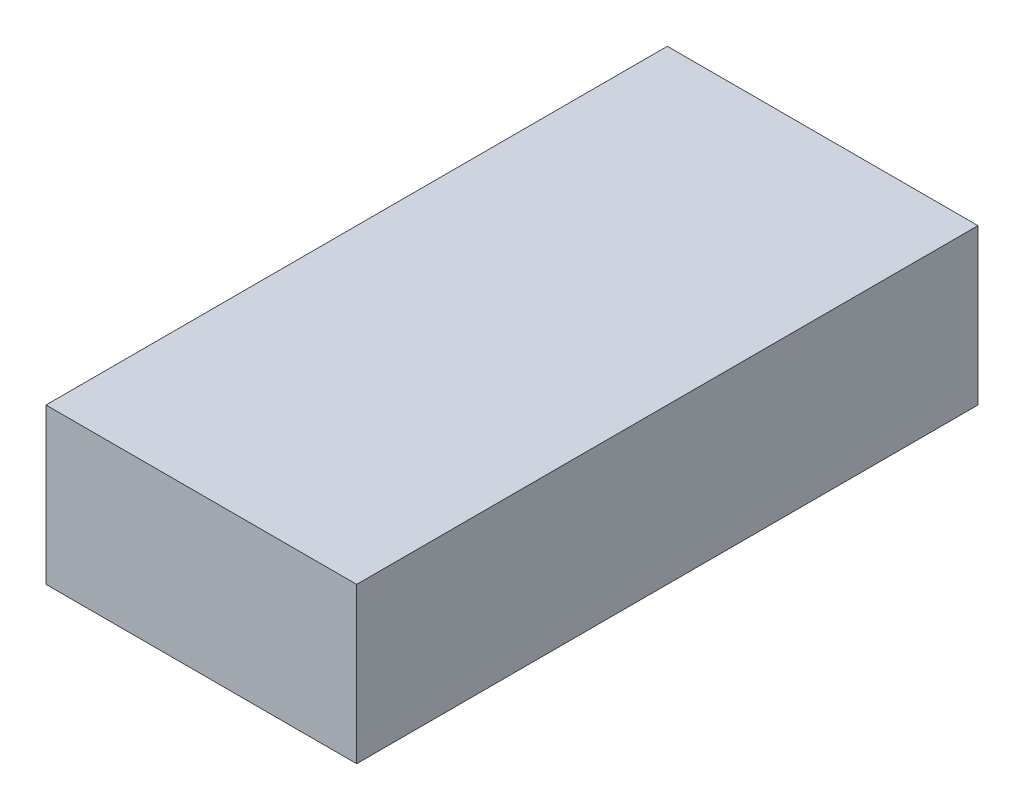
ISO-10303-21;
HEADER;
FILE_DESCRIPTION(('STEP AP214'),'2;1');
FILE_NAME('part.step','',(''),(''),'','','');
FILE_SCHEMA(('AUTOMOTIVE_DESIGN { 1 0 10303 214 1 1 1 1 }'));
ENDSEC;
DATA;
#1=APPLICATION_CONTEXT('core data for automotive mechanical design processes');
#2=APPLICATION_PROTOCOL_DEFINITION('international standard','automotive_design',2000,#1);
#3=PRODUCT_CONTEXT('',#1,'mechanical');
#4=PRODUCT('Part','Part','',(#3));
#5=PRODUCT_RELATED_PRODUCT_CATEGORY('part','',(#4));
#6=PRODUCT_DEFINITION_FORMATION('','',#4);
#7=PRODUCT_DEFINITION_CONTEXT('part definition',#1,'design');
#8=PRODUCT_DEFINITION('design','',#6,#7);
#9=PRODUCT_DEFINITION_SHAPE('','',#8);
#10=(LENGTH_UNIT() NAMED_UNIT(*) SI_UNIT(.MILLI.,.METRE.));
#11=(NAMED_UNIT(*) PLANE_ANGLE_UNIT() SI_UNIT($,.RADIAN.));
#12=(NAMED_UNIT(*) SI_UNIT($,.STERADIAN.) SOLID_ANGLE_UNIT());
#13=UNCERTAINTY_MEASURE_WITH_UNIT(LENGTH_MEASURE(1.E-05),#10,'distance_accuracy_value','');
#14=(GEOMETRIC_REPRESENTATION_CONTEXT(3) GLOBAL_UNCERTAINTY_ASSIGNED_CONTEXT((#13)) GLOBAL_UNIT_ASSIGNED_CONTEXT((#10,
#11,#12)) REPRESENTATION_CONTEXT('',''));
#15=CARTESIAN_POINT('',(0.,0.,0.));
#16=DIRECTION('',(0.,0.,1.));
#17=DIRECTION('',(1.,0.,0.));
#18=AXIS2_PLACEMENT_3D('',#15,#16,#17);
#19=CARTESIAN_POINT('',(-50.1520274344575,25.,-82.6699800488262));
#20=DIRECTION('',(1.,0.,0.));
#21=DIRECTION('',(0.,0.,-1.));
#22=AXIS2_PLACEMENT_3D('',#19,#20,#21);
#23=PLANE('',#22);
#24=DIRECTION('',(0.,0.,1.));
#25=VECTOR('',#24,1.);
#26=CARTESIAN_POINT('',(-50.1520274344575,0.,-82.6699800488262));
#27=LINE('',#26,#25);
#28=CARTESIAN_POINT('',(-50.1520274344575,0.,-82.6699800488262));
#29=VERTEX_POINT('',#28);
#30=CARTESIAN_POINT('',(-50.1520274344575,0.,17.3300199511738));
#31=VERTEX_POINT('',#30);
#32=EDGE_CURVE('E100',#29,#31,#27,.T.);
#33=ORIENTED_EDGE('',*,*,#32,.T.);
#34=DIRECTION('',(0.,-1.,0.));
#35=VECTOR('',#34,1.);
#36=CARTESIAN_POINT('',(-50.1520274344575,25.,17.3300199511738));
#37=LINE('',#36,#35);
#38=CARTESIAN_POINT('',(-50.1520274344575,25.,17.3300199511738));
#39=VERTEX_POINT('',#38);
#40=EDGE_CURVE('E11',#39,#31,#37,.T.);
#41=ORIENTED_EDGE('',*,*,#40,.F.);
#42=DIRECTION('',(0.,0.,1.));
#43=VECTOR('',#42,1.);
#44=CARTESIAN_POINT('',(-50.1520274344575,25.,-82.6699800488262));
#45=LINE('',#44,#43);
#46=CARTESIAN_POINT('',(-50.1520274344575,25.,-82.6699800488262));
#47=VERTEX_POINT('',#46);
#48=EDGE_CURVE('E88',#47,#39,#45,.T.);
#49=ORIENTED_EDGE('',*,*,#48,.F.);
#50=DIRECTION('',(0.,-1.,0.));
#51=VECTOR('',#50,1.);
#52=CARTESIAN_POINT('',(-50.1520274344575,25.,-82.6699800488262));
#53=LINE('',#52,#51);
#54=EDGE_CURVE('E96',#47,#29,#53,.T.);
#55=ORIENTED_EDGE('',*,*,#54,.T.);
#56=EDGE_LOOP('',(#33,#41,#49,#55));
#57=FACE_BOUND('',#56,.T.);
#58=ADVANCED_FACE('F37',(#57),#23,.F.);
#59=CARTESIAN_POINT('',(-50.1520274344575,25.,17.3300199511738));
#60=DIRECTION('',(0.,0.,-1.));
#61=DIRECTION('',(-1.,0.,0.));
#62=AXIS2_PLACEMENT_3D('',#59,#60,#61);
#63=PLANE('',#62);
#64=DIRECTION('',(1.,0.,0.));
#65=VECTOR('',#64,1.);
#66=CARTESIAN_POINT('',(-50.1520274344575,0.,17.3300199511738));
#67=LINE('',#66,#65);
#68=CARTESIAN_POINT('',(-0.152027434457504,0.,17.3300199511738));
#69=VERTEX_POINT('',#68);
#70=EDGE_CURVE('E92',#31,#69,#67,.T.);
#71=ORIENTED_EDGE('',*,*,#70,.T.);
#72=DIRECTION('',(0.,-1.,0.));
#73=VECTOR('',#72,1.);
#74=CARTESIAN_POINT('',(-0.152027434457504,25.,17.3300199511738));
#75=LINE('',#74,#73);
#76=CARTESIAN_POINT('',(-0.152027434457504,25.,17.3300199511738));
#77=VERTEX_POINT('',#76);
#78=EDGE_CURVE('E45',#77,#69,#75,.T.);
#79=ORIENTED_EDGE('',*,*,#78,.F.);
#80=DIRECTION('',(1.,0.,0.));
#81=VECTOR('',#80,1.);
#82=CARTESIAN_POINT('',(-50.1520274344575,25.,17.3300199511738));
#83=LINE('',#82,#81);
#84=EDGE_CURVE('E83',#39,#77,#83,.T.);
#85=ORIENTED_EDGE('',*,*,#84,.F.);
#86=ORIENTED_EDGE('',*,*,#40,.T.);
#87=EDGE_LOOP('',(#71,#79,#85,#86));
#88=FACE_BOUND('',#87,.T.);
#89=ADVANCED_FACE('F91',(#88),#63,.F.);
#90=CARTESIAN_POINT('',(-0.152027434457516,25.,-82.6699800488262));
#91=DIRECTION('',(-1.,0.,0.));
#92=DIRECTION('',(0.,0.,1.));
#93=AXIS2_PLACEMENT_3D('',#90,#91,#92);
#94=PLANE('',#93);
#95=DIRECTION('',(0.,0.,-1.));
#96=VECTOR('',#95,1.);
#97=CARTESIAN_POINT('',(-0.152027434457516,0.,-82.6699800488262));
#98=LINE('',#97,#96);
#99=CARTESIAN_POINT('',(-0.152027434457516,0.,-82.6699800488262));
#100=VERTEX_POINT('',#99);
#101=EDGE_CURVE('E70',#69,#100,#98,.T.);
#102=ORIENTED_EDGE('',*,*,#101,.T.);
#103=DIRECTION('',(0.,-1.,0.));
#104=VECTOR('',#103,1.);
#105=CARTESIAN_POINT('',(-0.152027434457516,25.,-82.6699800488262));
#106=LINE('',#105,#104);
#107=CARTESIAN_POINT('',(-0.152027434457516,25.,-82.6699800488262));
#108=VERTEX_POINT('',#107);
#109=EDGE_CURVE('E93',#108,#100,#106,.T.);
#110=ORIENTED_EDGE('',*,*,#109,.F.);
#111=DIRECTION('',(0.,0.,-1.));
#112=VECTOR('',#111,1.);
#113=CARTESIAN_POINT('',(-0.152027434457516,25.,-82.6699800488262));
#114=LINE('',#113,#112);
#115=EDGE_CURVE('E86',#77,#108,#114,.T.);
#116=ORIENTED_EDGE('',*,*,#115,.F.);
#117=ORIENTED_EDGE('',*,*,#78,.T.);
#118=EDGE_LOOP('',(#102,#110,#116,#117));
#119=FACE_BOUND('',#118,.T.);
#120=ADVANCED_FACE('F94',(#119),#94,.F.);
#121=CARTESIAN_POINT('',(-50.1520274344575,25.,-82.6699800488262));
#122=DIRECTION('',(0.,0.,1.));
#123=DIRECTION('',(1.,0.,0.));
#124=AXIS2_PLACEMENT_3D('',#121,#122,#123);
#125=PLANE('',#124);
#126=DIRECTION('',(-1.,0.,0.));
#127=VECTOR('',#126,1.);
#128=CARTESIAN_POINT('',(-50.1520274344575,0.,-82.6699800488262));
#129=LINE('',#128,#127);
#130=EDGE_CURVE('E76',#100,#29,#129,.T.);
#131=ORIENTED_EDGE('',*,*,#130,.T.);
#132=ORIENTED_EDGE('',*,*,#54,.F.);
#133=DIRECTION('',(-1.,0.,0.));
#134=VECTOR('',#133,1.);
#135=CARTESIAN_POINT('',(-50.1520274344575,25.,-82.6699800488262));
#136=LINE('',#135,#134);
#137=EDGE_CURVE('E53',#108,#47,#136,.T.);
#138=ORIENTED_EDGE('',*,*,#137,.F.);
#139=ORIENTED_EDGE('',*,*,#109,.T.);
#140=EDGE_LOOP('',(#131,#132,#138,#139));
#141=FACE_BOUND('',#140,.T.);
#142=ADVANCED_FACE('F107',(#141),#125,.F.);
#143=CARTESIAN_POINT('',(0.,25.,0.));
#144=DIRECTION('',(0.,1.,0.));
#145=DIRECTION('',(0.,0.,1.));
#146=AXIS2_PLACEMENT_3D('',#143,#144,#145);
#147=PLANE('',#146);
#148=ORIENTED_EDGE('',*,*,#48,.T.);
#149=ORIENTED_EDGE('',*,*,#84,.T.);
#150=ORIENTED_EDGE('',*,*,#115,.T.);
#151=ORIENTED_EDGE('',*,*,#137,.T.);
#152=EDGE_LOOP('',(#148,#149,#150,#151));
#153=FACE_BOUND('',#152,.T.);
#154=ADVANCED_FACE('F84',(#153),#147,.T.);
#155=CARTESIAN_POINT('',(0.,0.,0.));
#156=DIRECTION('',(0.,1.,0.));
#157=DIRECTION('',(0.,0.,1.));
#158=AXIS2_PLACEMENT_3D('',#155,#156,#157);
#159=PLANE('',#158);
#160=ORIENTED_EDGE('',*,*,#32,.F.);
#161=ORIENTED_EDGE('',*,*,#130,.F.);
#162=ORIENTED_EDGE('',*,*,#101,.F.);
#163=ORIENTED_EDGE('',*,*,#70,.F.);
#164=EDGE_LOOP('',(#160,#161,#162,#163));
#165=FACE_BOUND('',#164,.T.);
#166=ADVANCED_FACE('F110',(#165),#159,.F.);
#167=CLOSED_SHELL('',(#58,#89,#120,#142,#154,#166));
#168=MANIFOLD_SOLID_BREP('B2',#167);
#169=ADVANCED_BREP_SHAPE_REPRESENTATION('',(#18,#168),#14);
#170=SHAPE_DEFINITION_REPRESENTATION(#9,#169);
ENDSEC;
END-ISO-10303-21;
